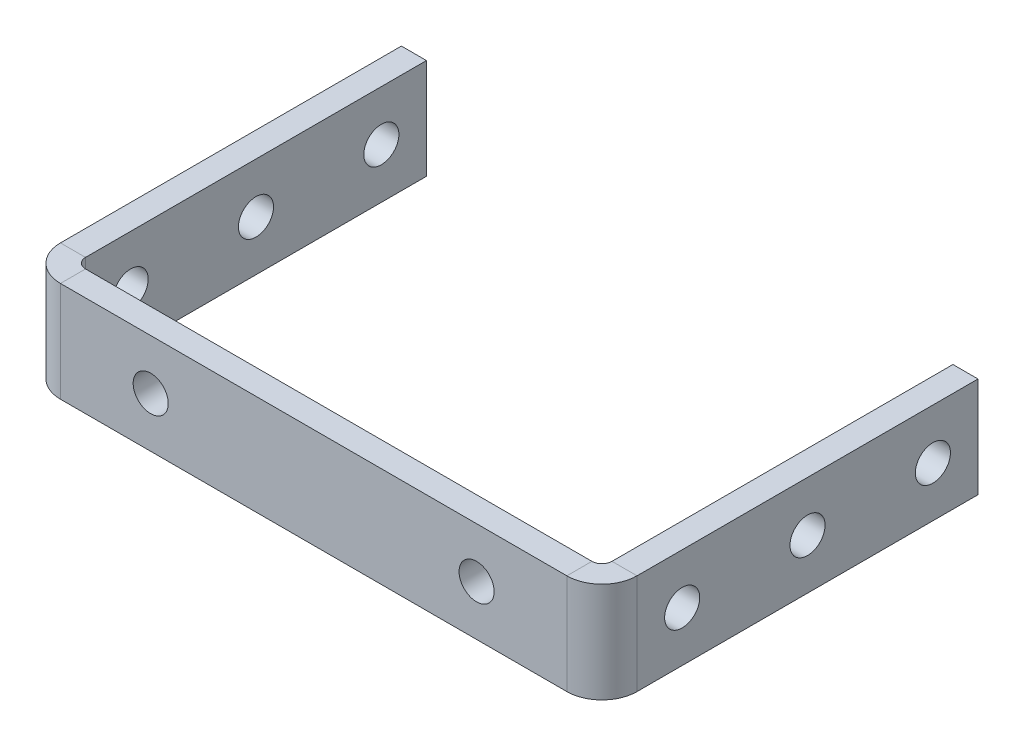
ISO-10303-21;
HEADER;
FILE_DESCRIPTION(('STEP AP214'),'2;1');
FILE_NAME('part.step','',(''),(''),'','','');
FILE_SCHEMA(('AUTOMOTIVE_DESIGN { 1 0 10303 214 1 1 1 1 }'));
ENDSEC;
DATA;
#1=APPLICATION_CONTEXT('core data for automotive mechanical design processes');
#2=APPLICATION_PROTOCOL_DEFINITION('international standard','automotive_design',2000,#1);
#3=PRODUCT_CONTEXT('',#1,'mechanical');
#4=PRODUCT('Part','Part','',(#3));
#5=PRODUCT_RELATED_PRODUCT_CATEGORY('part','',(#4));
#6=PRODUCT_DEFINITION_FORMATION('','',#4);
#7=PRODUCT_DEFINITION_CONTEXT('part definition',#1,'design');
#8=PRODUCT_DEFINITION('design','',#6,#7);
#9=PRODUCT_DEFINITION_SHAPE('','',#8);
#10=(LENGTH_UNIT() NAMED_UNIT(*) SI_UNIT(.MILLI.,.METRE.));
#11=(NAMED_UNIT(*) PLANE_ANGLE_UNIT() SI_UNIT($,.RADIAN.));
#12=(NAMED_UNIT(*) SI_UNIT($,.STERADIAN.) SOLID_ANGLE_UNIT());
#13=UNCERTAINTY_MEASURE_WITH_UNIT(LENGTH_MEASURE(1.E-05),#10,'distance_accuracy_value','');
#14=(GEOMETRIC_REPRESENTATION_CONTEXT(3) GLOBAL_UNCERTAINTY_ASSIGNED_CONTEXT((#13)) GLOBAL_UNIT_ASSIGNED_CONTEXT((#10,
#11,#12)) REPRESENTATION_CONTEXT('',''));
#15=CARTESIAN_POINT('',(0.,0.,0.));
#16=DIRECTION('',(0.,0.,1.));
#17=DIRECTION('',(1.,0.,0.));
#18=AXIS2_PLACEMENT_3D('',#15,#16,#17);
#19=CARTESIAN_POINT('',(-101.,40.,0.));
#20=DIRECTION('',(0.,1.,0.));
#21=DIRECTION('',(0.,0.,1.));
#22=AXIS2_PLACEMENT_3D('',#19,#20,#21);
#23=PLANE('',#22);
#24=DIRECTION('',(0.,0.,1.));
#25=VECTOR('',#24,1.);
#26=CARTESIAN_POINT('',(-101.,40.,0.));
#27=LINE('',#26,#25);
#28=CARTESIAN_POINT('',(-101.,40.,0.));
#29=VERTEX_POINT('',#28);
#30=CARTESIAN_POINT('',(-101.,40.,10.));
#31=VERTEX_POINT('',#30);
#32=EDGE_CURVE('E11',#29,#31,#27,.T.);
#33=ORIENTED_EDGE('',*,*,#32,.F.);
#34=CARTESIAN_POINT('',(-101.,40.,-4.));
#35=DIRECTION('',(0.,-1.,0.));
#36=DIRECTION('',(0.,0.,-1.));
#37=AXIS2_PLACEMENT_3D('',#34,#35,#36);
#38=CIRCLE('',#37,4.);
#39=CARTESIAN_POINT('',(-105.,40.,-4.));
#40=VERTEX_POINT('',#39);
#41=EDGE_CURVE('E249',#40,#29,#38,.F.);
#42=ORIENTED_EDGE('',*,*,#41,.F.);
#43=DIRECTION('',(1.,0.,0.));
#44=VECTOR('',#43,1.);
#45=CARTESIAN_POINT('',(-115.,40.,-4.00000000000001));
#46=LINE('',#45,#44);
#47=CARTESIAN_POINT('',(-115.,40.,-4.00000000000001));
#48=VERTEX_POINT('',#47);
#49=EDGE_CURVE('E46',#48,#40,#46,.T.);
#50=ORIENTED_EDGE('',*,*,#49,.F.);
#51=CARTESIAN_POINT('',(-101.,40.,-4.));
#52=DIRECTION('',(0.,1.,0.));
#53=DIRECTION('',(1.,0.,0.));
#54=AXIS2_PLACEMENT_3D('',#51,#52,#53);
#55=CIRCLE('',#54,14.);
#56=EDGE_CURVE('E147',#48,#31,#55,.T.);
#57=ORIENTED_EDGE('',*,*,#56,.T.);
#58=EDGE_LOOP('',(#33,#42,#50,#57));
#59=FACE_BOUND('',#58,.T.);
#60=ADVANCED_FACE('F38',(#59),#23,.T.);
#61=CARTESIAN_POINT('',(-115.,40.,-4.00000000000001));
#62=DIRECTION('',(0.,1.,0.));
#63=DIRECTION('',(0.,0.,1.));
#64=AXIS2_PLACEMENT_3D('',#61,#62,#63);
#65=PLANE('',#64);
#66=DIRECTION('',(1.,0.,0.));
#67=VECTOR('',#66,1.);
#68=CARTESIAN_POINT('',(-105.,40.,0.));
#69=LINE('',#68,#67);
#70=CARTESIAN_POINT('',(101.,40.,0.));
#71=VERTEX_POINT('',#70);
#72=EDGE_CURVE('E141',#29,#71,#69,.T.);
#73=ORIENTED_EDGE('',*,*,#72,.F.);
#74=ORIENTED_EDGE('',*,*,#32,.T.);
#75=DIRECTION('',(1.,0.,0.));
#76=VECTOR('',#75,1.);
#77=CARTESIAN_POINT('',(-105.,40.,10.));
#78=LINE('',#77,#76);
#79=CARTESIAN_POINT('',(101.,40.,10.));
#80=VERTEX_POINT('',#79);
#81=EDGE_CURVE('E138',#31,#80,#78,.T.);
#82=ORIENTED_EDGE('',*,*,#81,.T.);
#83=DIRECTION('',(0.,0.,-1.));
#84=VECTOR('',#83,1.);
#85=CARTESIAN_POINT('',(101.,40.,10.));
#86=LINE('',#85,#84);
#87=EDGE_CURVE('E230',#80,#71,#86,.T.);
#88=ORIENTED_EDGE('',*,*,#87,.T.);
#89=EDGE_LOOP('',(#73,#74,#82,#88));
#90=FACE_BOUND('',#89,.T.);
#91=ADVANCED_FACE('F136',(#90),#65,.T.);
#92=CARTESIAN_POINT('',(-105.,0.,-4.));
#93=DIRECTION('',(0.,-1.,0.));
#94=DIRECTION('',(0.,0.,-1.));
#95=AXIS2_PLACEMENT_3D('',#92,#93,#94);
#96=PLANE('',#95);
#97=DIRECTION('',(-1.,0.,0.));
#98=VECTOR('',#97,1.);
#99=CARTESIAN_POINT('',(-105.,0.,-4.));
#100=LINE('',#99,#98);
#101=CARTESIAN_POINT('',(-105.,0.,-4.));
#102=VERTEX_POINT('',#101);
#103=CARTESIAN_POINT('',(-115.,0.,-4.00000000000001));
#104=VERTEX_POINT('',#103);
#105=EDGE_CURVE('E235',#102,#104,#100,.T.);
#106=ORIENTED_EDGE('',*,*,#105,.F.);
#107=CARTESIAN_POINT('',(-101.,0.,-4.));
#108=DIRECTION('',(0.,-1.,0.));
#109=DIRECTION('',(0.,0.,-1.));
#110=AXIS2_PLACEMENT_3D('',#107,#108,#109);
#111=CIRCLE('',#110,4.);
#112=CARTESIAN_POINT('',(-101.,0.,0.));
#113=VERTEX_POINT('',#112);
#114=EDGE_CURVE('E187',#102,#113,#111,.F.);
#115=ORIENTED_EDGE('',*,*,#114,.T.);
#116=DIRECTION('',(0.,0.,-1.));
#117=VECTOR('',#116,1.);
#118=CARTESIAN_POINT('',(-101.,0.,10.));
#119=LINE('',#118,#117);
#120=CARTESIAN_POINT('',(-101.,0.,10.));
#121=VERTEX_POINT('',#120);
#122=EDGE_CURVE('E233',#121,#113,#119,.T.);
#123=ORIENTED_EDGE('',*,*,#122,.F.);
#124=CARTESIAN_POINT('',(-101.,0.,-4.));
#125=DIRECTION('',(0.,1.,0.));
#126=DIRECTION('',(1.,0.,0.));
#127=AXIS2_PLACEMENT_3D('',#124,#125,#126);
#128=CIRCLE('',#127,14.);
#129=EDGE_CURVE('E159',#104,#121,#128,.T.);
#130=ORIENTED_EDGE('',*,*,#129,.F.);
#131=EDGE_LOOP('',(#106,#115,#123,#130));
#132=FACE_BOUND('',#131,.T.);
#133=ADVANCED_FACE('F351',(#132),#96,.T.);
#134=CARTESIAN_POINT('',(-101.,0.,10.));
#135=DIRECTION('',(0.,-1.,0.));
#136=DIRECTION('',(0.,0.,-1.));
#137=AXIS2_PLACEMENT_3D('',#134,#135,#136);
#138=PLANE('',#137);
#139=DIRECTION('',(0.,0.,1.));
#140=VECTOR('',#139,1.);
#141=CARTESIAN_POINT('',(-105.,0.,-140.));
#142=LINE('',#141,#140);
#143=CARTESIAN_POINT('',(-105.,0.,-140.));
#144=VERTEX_POINT('',#143);
#145=EDGE_CURVE('E190',#144,#102,#142,.T.);
#146=ORIENTED_EDGE('',*,*,#145,.T.);
#147=ORIENTED_EDGE('',*,*,#105,.T.);
#148=DIRECTION('',(0.,0.,1.));
#149=VECTOR('',#148,1.);
#150=CARTESIAN_POINT('',(-115.,0.,-140.));
#151=LINE('',#150,#149);
#152=CARTESIAN_POINT('',(-115.,0.,-140.));
#153=VERTEX_POINT('',#152);
#154=EDGE_CURVE('E196',#153,#104,#151,.T.);
#155=ORIENTED_EDGE('',*,*,#154,.F.);
#156=DIRECTION('',(1.,0.,0.));
#157=VECTOR('',#156,1.);
#158=CARTESIAN_POINT('',(-115.,0.,-140.));
#159=LINE('',#158,#157);
#160=EDGE_CURVE('E193',#153,#144,#159,.T.);
#161=ORIENTED_EDGE('',*,*,#160,.T.);
#162=EDGE_LOOP('',(#146,#147,#155,#161));
#163=FACE_BOUND('',#162,.T.);
#164=ADVANCED_FACE('F354',(#163),#138,.T.);
#165=CARTESIAN_POINT('',(105.,40.,-4.));
#166=DIRECTION('',(0.,1.,0.));
#167=DIRECTION('',(0.,0.,1.));
#168=AXIS2_PLACEMENT_3D('',#165,#166,#167);
#169=PLANE('',#168);
#170=DIRECTION('',(1.,0.,0.));
#171=VECTOR('',#170,1.);
#172=CARTESIAN_POINT('',(105.,40.,-4.));
#173=LINE('',#172,#171);
#174=CARTESIAN_POINT('',(105.,40.,-4.));
#175=VERTEX_POINT('',#174);
#176=CARTESIAN_POINT('',(115.,40.,-4.));
#177=VERTEX_POINT('',#176);
#178=EDGE_CURVE('E54',#175,#177,#173,.T.);
#179=ORIENTED_EDGE('',*,*,#178,.F.);
#180=CARTESIAN_POINT('',(101.,40.,-4.));
#181=DIRECTION('',(0.,-1.,0.));
#182=DIRECTION('',(0.,0.,-1.));
#183=AXIS2_PLACEMENT_3D('',#180,#181,#182);
#184=CIRCLE('',#183,4.);
#185=EDGE_CURVE('E259',#71,#175,#184,.F.);
#186=ORIENTED_EDGE('',*,*,#185,.F.);
#187=ORIENTED_EDGE('',*,*,#87,.F.);
#188=CARTESIAN_POINT('',(101.,40.,-4.));
#189=DIRECTION('',(0.,1.,0.));
#190=DIRECTION('',(1.,0.,0.));
#191=AXIS2_PLACEMENT_3D('',#188,#189,#190);
#192=CIRCLE('',#191,14.);
#193=EDGE_CURVE('E167',#80,#177,#192,.T.);
#194=ORIENTED_EDGE('',*,*,#193,.T.);
#195=EDGE_LOOP('',(#179,#186,#187,#194));
#196=FACE_BOUND('',#195,.T.);
#197=ADVANCED_FACE('F346',(#196),#169,.T.);
#198=CARTESIAN_POINT('',(101.,40.,10.));
#199=DIRECTION('',(0.,1.,0.));
#200=DIRECTION('',(0.,0.,1.));
#201=AXIS2_PLACEMENT_3D('',#198,#199,#200);
#202=PLANE('',#201);
#203=DIRECTION('',(0.,0.,-1.));
#204=VECTOR('',#203,1.);
#205=CARTESIAN_POINT('',(105.,40.,0.));
#206=LINE('',#205,#204);
#207=CARTESIAN_POINT('',(105.,40.,-140.));
#208=VERTEX_POINT('',#207);
#209=EDGE_CURVE('E262',#175,#208,#206,.T.);
#210=ORIENTED_EDGE('',*,*,#209,.F.);
#211=ORIENTED_EDGE('',*,*,#178,.T.);
#212=DIRECTION('',(0.,0.,-1.));
#213=VECTOR('',#212,1.);
#214=CARTESIAN_POINT('',(115.,40.,0.));
#215=LINE('',#214,#213);
#216=CARTESIAN_POINT('',(115.,40.,-140.));
#217=VERTEX_POINT('',#216);
#218=EDGE_CURVE('E108',#177,#217,#215,.T.);
#219=ORIENTED_EDGE('',*,*,#218,.T.);
#220=DIRECTION('',(1.,0.,0.));
#221=VECTOR('',#220,1.);
#222=CARTESIAN_POINT('',(105.,40.,-140.));
#223=LINE('',#222,#221);
#224=EDGE_CURVE('E265',#208,#217,#223,.T.);
#225=ORIENTED_EDGE('',*,*,#224,.F.);
#226=EDGE_LOOP('',(#210,#211,#219,#225));
#227=FACE_BOUND('',#226,.T.);
#228=ADVANCED_FACE('F336',(#227),#202,.T.);
#229=CARTESIAN_POINT('',(101.,0.,0.));
#230=DIRECTION('',(0.,-1.,0.));
#231=DIRECTION('',(0.,0.,-1.));
#232=AXIS2_PLACEMENT_3D('',#229,#230,#231);
#233=PLANE('',#232);
#234=DIRECTION('',(0.,0.,1.));
#235=VECTOR('',#234,1.);
#236=CARTESIAN_POINT('',(101.,0.,0.));
#237=LINE('',#236,#235);
#238=CARTESIAN_POINT('',(101.,0.,0.));
#239=VERTEX_POINT('',#238);
#240=CARTESIAN_POINT('',(101.,0.,10.));
#241=VERTEX_POINT('',#240);
#242=EDGE_CURVE('E95',#239,#241,#237,.T.);
#243=ORIENTED_EDGE('',*,*,#242,.F.);
#244=CARTESIAN_POINT('',(101.,0.,-4.));
#245=DIRECTION('',(0.,-1.,0.));
#246=DIRECTION('',(0.,0.,-1.));
#247=AXIS2_PLACEMENT_3D('',#244,#245,#246);
#248=CIRCLE('',#247,4.);
#249=CARTESIAN_POINT('',(105.,0.,-4.));
#250=VERTEX_POINT('',#249);
#251=EDGE_CURVE('E183',#239,#250,#248,.F.);
#252=ORIENTED_EDGE('',*,*,#251,.T.);
#253=DIRECTION('',(-1.,0.,0.));
#254=VECTOR('',#253,1.);
#255=CARTESIAN_POINT('',(115.,0.,-4.));
#256=LINE('',#255,#254);
#257=CARTESIAN_POINT('',(115.,0.,-4.));
#258=VERTEX_POINT('',#257);
#259=EDGE_CURVE('E102',#258,#250,#256,.T.);
#260=ORIENTED_EDGE('',*,*,#259,.F.);
#261=CARTESIAN_POINT('',(101.,0.,-4.));
#262=DIRECTION('',(0.,1.,0.));
#263=DIRECTION('',(1.,0.,0.));
#264=AXIS2_PLACEMENT_3D('',#261,#262,#263);
#265=CIRCLE('',#264,14.);
#266=EDGE_CURVE('E202',#241,#258,#265,.T.);
#267=ORIENTED_EDGE('',*,*,#266,.F.);
#268=EDGE_LOOP('',(#243,#252,#260,#267));
#269=FACE_BOUND('',#268,.T.);
#270=ADVANCED_FACE('F385',(#269),#233,.T.);
#271=CARTESIAN_POINT('',(115.,0.,-4.));
#272=DIRECTION('',(0.,-1.,0.));
#273=DIRECTION('',(0.,0.,-1.));
#274=AXIS2_PLACEMENT_3D('',#271,#272,#273);
#275=PLANE('',#274);
#276=DIRECTION('',(1.,0.,0.));
#277=VECTOR('',#276,1.);
#278=CARTESIAN_POINT('',(-105.,0.,0.));
#279=LINE('',#278,#277);
#280=EDGE_CURVE('E185',#113,#239,#279,.T.);
#281=ORIENTED_EDGE('',*,*,#280,.T.);
#282=ORIENTED_EDGE('',*,*,#242,.T.);
#283=DIRECTION('',(1.,0.,0.));
#284=VECTOR('',#283,1.);
#285=CARTESIAN_POINT('',(-105.,0.,10.));
#286=LINE('',#285,#284);
#287=EDGE_CURVE('E200',#121,#241,#286,.T.);
#288=ORIENTED_EDGE('',*,*,#287,.F.);
#289=ORIENTED_EDGE('',*,*,#122,.T.);
#290=EDGE_LOOP('',(#281,#282,#288,#289));
#291=FACE_BOUND('',#290,.T.);
#292=ADVANCED_FACE('F323',(#291),#275,.T.);
#293=CARTESIAN_POINT('',(115.,40.,0.));
#294=DIRECTION('',(-1.,0.,0.));
#295=DIRECTION('',(0.,0.,1.));
#296=AXIS2_PLACEMENT_3D('',#293,#294,#295);
#297=PLANE('',#296);
#298=CARTESIAN_POINT('',(115.,20.,-122.));
#299=DIRECTION('',(1.,0.,0.));
#300=DIRECTION('',(0.,0.,-1.));
#301=AXIS2_PLACEMENT_3D('',#298,#299,#300);
#302=CIRCLE('',#301,7.00000000000004);
#303=CARTESIAN_POINT('',(115.,20.,-129.));
#304=VERTEX_POINT('',#303);
#305=EDGE_CURVE('E309',#304,#304,#302,.T.);
#306=ORIENTED_EDGE('',*,*,#305,.F.);
#307=EDGE_LOOP('',(#306));
#308=FACE_BOUND('',#307,.T.);
#309=CARTESIAN_POINT('',(115.,20.,-72.));
#310=DIRECTION('',(1.,0.,0.));
#311=DIRECTION('',(0.,0.,-1.));
#312=AXIS2_PLACEMENT_3D('',#309,#310,#311);
#313=CIRCLE('',#312,7.);
#314=CARTESIAN_POINT('',(115.,20.,-79.));
#315=VERTEX_POINT('',#314);
#316=EDGE_CURVE('E302',#315,#315,#313,.T.);
#317=ORIENTED_EDGE('',*,*,#316,.F.);
#318=EDGE_LOOP('',(#317));
#319=FACE_BOUND('',#318,.T.);
#320=CARTESIAN_POINT('',(115.,20.,-22.));
#321=DIRECTION('',(1.,0.,0.));
#322=DIRECTION('',(0.,0.,-1.));
#323=AXIS2_PLACEMENT_3D('',#320,#321,#322);
#324=CIRCLE('',#323,7.);
#325=CARTESIAN_POINT('',(115.,20.,-29.));
#326=VERTEX_POINT('',#325);
#327=EDGE_CURVE('E303',#326,#326,#324,.T.);
#328=ORIENTED_EDGE('',*,*,#327,.F.);
#329=EDGE_LOOP('',(#328));
#330=FACE_BOUND('',#329,.T.);
#331=DIRECTION('',(0.,0.,-1.));
#332=VECTOR('',#331,1.);
#333=CARTESIAN_POINT('',(115.,0.,0.));
#334=LINE('',#333,#332);
#335=CARTESIAN_POINT('',(115.,0.,-140.));
#336=VERTEX_POINT('',#335);
#337=EDGE_CURVE('E173',#258,#336,#334,.T.);
#338=ORIENTED_EDGE('',*,*,#337,.T.);
#339=DIRECTION('',(0.,-1.,0.));
#340=VECTOR('',#339,1.);
#341=CARTESIAN_POINT('',(115.,40.,-140.));
#342=LINE('',#341,#340);
#343=EDGE_CURVE('E226',#217,#336,#342,.T.);
#344=ORIENTED_EDGE('',*,*,#343,.F.);
#345=ORIENTED_EDGE('',*,*,#218,.F.);
#346=DIRECTION('',(0.,-1.,0.));
#347=VECTOR('',#346,1.);
#348=CARTESIAN_POINT('',(115.,40.,-4.));
#349=LINE('',#348,#347);
#350=EDGE_CURVE('E169',#177,#258,#349,.T.);
#351=ORIENTED_EDGE('',*,*,#350,.T.);
#352=EDGE_LOOP('',(#338,#344,#345,#351));
#353=FACE_BOUND('',#352,.T.);
#354=ADVANCED_FACE('F319',(#308,#319,#330,#353),#297,.F.);
#355=CARTESIAN_POINT('',(105.,40.,-140.));
#356=DIRECTION('',(0.,0.,-1.));
#357=DIRECTION('',(-1.,0.,0.));
#358=AXIS2_PLACEMENT_3D('',#355,#356,#357);
#359=PLANE('',#358);
#360=DIRECTION('',(1.,0.,0.));
#361=VECTOR('',#360,1.);
#362=CARTESIAN_POINT('',(105.,0.,-140.));
#363=LINE('',#362,#361);
#364=CARTESIAN_POINT('',(105.,0.,-140.));
#365=VERTEX_POINT('',#364);
#366=EDGE_CURVE('E176',#365,#336,#363,.T.);
#367=ORIENTED_EDGE('',*,*,#366,.F.);
#368=DIRECTION('',(0.,-1.,0.));
#369=VECTOR('',#368,1.);
#370=CARTESIAN_POINT('',(105.,40.,-140.));
#371=LINE('',#370,#369);
#372=EDGE_CURVE('E224',#208,#365,#371,.T.);
#373=ORIENTED_EDGE('',*,*,#372,.F.);
#374=ORIENTED_EDGE('',*,*,#224,.T.);
#375=ORIENTED_EDGE('',*,*,#343,.T.);
#376=EDGE_LOOP('',(#367,#373,#374,#375));
#377=FACE_BOUND('',#376,.T.);
#378=ADVANCED_FACE('F322',(#377),#359,.T.);
#379=CARTESIAN_POINT('',(105.,40.,0.));
#380=DIRECTION('',(-1.,0.,0.));
#381=DIRECTION('',(0.,0.,1.));
#382=AXIS2_PLACEMENT_3D('',#379,#380,#381);
#383=PLANE('',#382);
#384=CARTESIAN_POINT('',(105.,20.,-122.));
#385=DIRECTION('',(-1.,0.,0.));
#386=DIRECTION('',(0.,0.,1.));
#387=AXIS2_PLACEMENT_3D('',#384,#385,#386);
#388=CIRCLE('',#387,7.00000000000004);
#389=CARTESIAN_POINT('',(105.,20.,-115.));
#390=VERTEX_POINT('',#389);
#391=EDGE_CURVE('E273',#390,#390,#388,.T.);
#392=ORIENTED_EDGE('',*,*,#391,.F.);
#393=EDGE_LOOP('',(#392));
#394=FACE_BOUND('',#393,.T.);
#395=CARTESIAN_POINT('',(105.,20.,-72.));
#396=DIRECTION('',(-1.,0.,0.));
#397=DIRECTION('',(0.,0.,1.));
#398=AXIS2_PLACEMENT_3D('',#395,#396,#397);
#399=CIRCLE('',#398,7.);
#400=CARTESIAN_POINT('',(105.,20.,-65.));
#401=VERTEX_POINT('',#400);
#402=EDGE_CURVE('E286',#401,#401,#399,.T.);
#403=ORIENTED_EDGE('',*,*,#402,.F.);
#404=EDGE_LOOP('',(#403));
#405=FACE_BOUND('',#404,.T.);
#406=CARTESIAN_POINT('',(105.,20.,-22.));
#407=DIRECTION('',(-1.,0.,0.));
#408=DIRECTION('',(0.,0.,1.));
#409=AXIS2_PLACEMENT_3D('',#406,#407,#408);
#410=CIRCLE('',#409,7.);
#411=CARTESIAN_POINT('',(105.,20.,-15.));
#412=VERTEX_POINT('',#411);
#413=EDGE_CURVE('E292',#412,#412,#410,.T.);
#414=ORIENTED_EDGE('',*,*,#413,.F.);
#415=EDGE_LOOP('',(#414));
#416=FACE_BOUND('',#415,.T.);
#417=DIRECTION('',(0.,0.,-1.));
#418=VECTOR('',#417,1.);
#419=CARTESIAN_POINT('',(105.,0.,0.));
#420=LINE('',#419,#418);
#421=EDGE_CURVE('E180',#250,#365,#420,.T.);
#422=ORIENTED_EDGE('',*,*,#421,.F.);
#423=DIRECTION('',(0.,-1.,0.));
#424=VECTOR('',#423,1.);
#425=CARTESIAN_POINT('',(105.,40.,-4.));
#426=LINE('',#425,#424);
#427=EDGE_CURVE('E221',#175,#250,#426,.T.);
#428=ORIENTED_EDGE('',*,*,#427,.F.);
#429=ORIENTED_EDGE('',*,*,#209,.T.);
#430=ORIENTED_EDGE('',*,*,#372,.T.);
#431=EDGE_LOOP('',(#422,#428,#429,#430));
#432=FACE_BOUND('',#431,.T.);
#433=ADVANCED_FACE('F339',(#394,#405,#416,#432),#383,.T.);
#434=CARTESIAN_POINT('',(101.,40.,-4.));
#435=DIRECTION('',(0.,-1.,0.));
#436=DIRECTION('',(0.,0.,-1.));
#437=AXIS2_PLACEMENT_3D('',#434,#435,#436);
#438=CYLINDRICAL_SURFACE('',#437,4.);
#439=ORIENTED_EDGE('',*,*,#251,.F.);
#440=DIRECTION('',(0.,-1.,0.));
#441=VECTOR('',#440,1.);
#442=CARTESIAN_POINT('',(101.,40.,0.));
#443=LINE('',#442,#441);
#444=EDGE_CURVE('E218',#71,#239,#443,.T.);
#445=ORIENTED_EDGE('',*,*,#444,.F.);
#446=ORIENTED_EDGE('',*,*,#185,.T.);
#447=ORIENTED_EDGE('',*,*,#427,.T.);
#448=EDGE_LOOP('',(#439,#445,#446,#447));
#449=FACE_BOUND('',#448,.T.);
#450=ADVANCED_FACE('F342',(#449),#438,.F.);
#451=CARTESIAN_POINT('',(-105.,40.,0.));
#452=DIRECTION('',(0.,0.,-1.));
#453=DIRECTION('',(-1.,0.,0.));
#454=AXIS2_PLACEMENT_3D('',#451,#452,#453);
#455=PLANE('',#454);
#456=CARTESIAN_POINT('',(-65.,20.,0.));
#457=DIRECTION('',(0.,0.,-1.));
#458=DIRECTION('',(-1.,0.,0.));
#459=AXIS2_PLACEMENT_3D('',#456,#457,#458);
#460=CIRCLE('',#459,7.);
#461=CARTESIAN_POINT('',(-72.,20.,0.));
#462=VERTEX_POINT('',#461);
#463=EDGE_CURVE('E276',#462,#462,#460,.F.);
#464=ORIENTED_EDGE('',*,*,#463,.T.);
#465=EDGE_LOOP('',(#464));
#466=FACE_BOUND('',#465,.T.);
#467=CARTESIAN_POINT('',(65.,20.,0.));
#468=DIRECTION('',(0.,0.,-1.));
#469=DIRECTION('',(-1.,0.,0.));
#470=AXIS2_PLACEMENT_3D('',#467,#468,#469);
#471=CIRCLE('',#470,7.);
#472=CARTESIAN_POINT('',(58.,20.,0.));
#473=VERTEX_POINT('',#472);
#474=EDGE_CURVE('E269',#473,#473,#471,.F.);
#475=ORIENTED_EDGE('',*,*,#474,.T.);
#476=EDGE_LOOP('',(#475));
#477=FACE_BOUND('',#476,.T.);
#478=ORIENTED_EDGE('',*,*,#280,.F.);
#479=DIRECTION('',(0.,-1.,0.));
#480=VECTOR('',#479,1.);
#481=CARTESIAN_POINT('',(-101.,40.,0.));
#482=LINE('',#481,#480);
#483=EDGE_CURVE('E215',#29,#113,#482,.T.);
#484=ORIENTED_EDGE('',*,*,#483,.F.);
#485=ORIENTED_EDGE('',*,*,#72,.T.);
#486=ORIENTED_EDGE('',*,*,#444,.T.);
#487=EDGE_LOOP('',(#478,#484,#485,#486));
#488=FACE_BOUND('',#487,.T.);
#489=ADVANCED_FACE('F349',(#466,#477,#488),#455,.T.);
#490=CARTESIAN_POINT('',(-101.,40.,-4.));
#491=DIRECTION('',(0.,-1.,0.));
#492=DIRECTION('',(0.,0.,-1.));
#493=AXIS2_PLACEMENT_3D('',#490,#491,#492);
#494=CYLINDRICAL_SURFACE('',#493,4.);
#495=ORIENTED_EDGE('',*,*,#114,.F.);
#496=DIRECTION('',(0.,-1.,0.));
#497=VECTOR('',#496,1.);
#498=CARTESIAN_POINT('',(-105.,40.,-4.));
#499=LINE('',#498,#497);
#500=EDGE_CURVE('E212',#40,#102,#499,.T.);
#501=ORIENTED_EDGE('',*,*,#500,.F.);
#502=ORIENTED_EDGE('',*,*,#41,.T.);
#503=ORIENTED_EDGE('',*,*,#483,.T.);
#504=EDGE_LOOP('',(#495,#501,#502,#503));
#505=FACE_BOUND('',#504,.T.);
#506=ADVANCED_FACE('F248',(#505),#494,.F.);
#507=CARTESIAN_POINT('',(-105.,40.,-140.));
#508=DIRECTION('',(1.,0.,0.));
#509=DIRECTION('',(0.,0.,-1.));
#510=AXIS2_PLACEMENT_3D('',#507,#508,#509);
#511=PLANE('',#510);
#512=CARTESIAN_POINT('',(-105.,20.,-122.));
#513=DIRECTION('',(1.,0.,0.));
#514=DIRECTION('',(0.,0.,-1.));
#515=AXIS2_PLACEMENT_3D('',#512,#513,#514);
#516=CIRCLE('',#515,7.00000000000004);
#517=CARTESIAN_POINT('',(-105.,20.,-129.));
#518=VERTEX_POINT('',#517);
#519=EDGE_CURVE('E283',#518,#518,#516,.T.);
#520=ORIENTED_EDGE('',*,*,#519,.F.);
#521=EDGE_LOOP('',(#520));
#522=FACE_BOUND('',#521,.T.);
#523=CARTESIAN_POINT('',(-105.,20.,-72.));
#524=DIRECTION('',(1.,0.,0.));
#525=DIRECTION('',(0.,0.,-1.));
#526=AXIS2_PLACEMENT_3D('',#523,#524,#525);
#527=CIRCLE('',#526,7.);
#528=CARTESIAN_POINT('',(-105.,20.,-79.));
#529=VERTEX_POINT('',#528);
#530=EDGE_CURVE('E289',#529,#529,#527,.T.);
#531=ORIENTED_EDGE('',*,*,#530,.F.);
#532=EDGE_LOOP('',(#531));
#533=FACE_BOUND('',#532,.T.);
#534=CARTESIAN_POINT('',(-105.,20.,-22.));
#535=DIRECTION('',(1.,0.,0.));
#536=DIRECTION('',(0.,0.,-1.));
#537=AXIS2_PLACEMENT_3D('',#534,#535,#536);
#538=CIRCLE('',#537,7.);
#539=CARTESIAN_POINT('',(-105.,20.,-29.));
#540=VERTEX_POINT('',#539);
#541=EDGE_CURVE('E295',#540,#540,#538,.T.);
#542=ORIENTED_EDGE('',*,*,#541,.F.);
#543=EDGE_LOOP('',(#542));
#544=FACE_BOUND('',#543,.T.);
#545=ORIENTED_EDGE('',*,*,#145,.F.);
#546=DIRECTION('',(0.,-1.,0.));
#547=VECTOR('',#546,1.);
#548=CARTESIAN_POINT('',(-105.,40.,-140.));
#549=LINE('',#548,#547);
#550=CARTESIAN_POINT('',(-105.,40.,-140.));
#551=VERTEX_POINT('',#550);
#552=EDGE_CURVE('E210',#551,#144,#549,.T.);
#553=ORIENTED_EDGE('',*,*,#552,.F.);
#554=DIRECTION('',(0.,0.,1.));
#555=VECTOR('',#554,1.);
#556=CARTESIAN_POINT('',(-105.,40.,-140.));
#557=LINE('',#556,#555);
#558=EDGE_CURVE('E242',#551,#40,#557,.T.);
#559=ORIENTED_EDGE('',*,*,#558,.T.);
#560=ORIENTED_EDGE('',*,*,#500,.T.);
#561=EDGE_LOOP('',(#545,#553,#559,#560));
#562=FACE_BOUND('',#561,.T.);
#563=ADVANCED_FACE('F253',(#522,#533,#544,#562),#511,.T.);
#564=CARTESIAN_POINT('',(-115.,40.,-140.));
#565=DIRECTION('',(0.,0.,-1.));
#566=DIRECTION('',(-1.,0.,0.));
#567=AXIS2_PLACEMENT_3D('',#564,#565,#566);
#568=PLANE('',#567);
#569=ORIENTED_EDGE('',*,*,#160,.F.);
#570=DIRECTION('',(0.,-1.,0.));
#571=VECTOR('',#570,1.);
#572=CARTESIAN_POINT('',(-115.,40.,-140.));
#573=LINE('',#572,#571);
#574=CARTESIAN_POINT('',(-115.,40.,-140.));
#575=VERTEX_POINT('',#574);
#576=EDGE_CURVE('E208',#575,#153,#573,.T.);
#577=ORIENTED_EDGE('',*,*,#576,.F.);
#578=DIRECTION('',(1.,0.,0.));
#579=VECTOR('',#578,1.);
#580=CARTESIAN_POINT('',(-115.,40.,-140.));
#581=LINE('',#580,#579);
#582=EDGE_CURVE('E254',#575,#551,#581,.T.);
#583=ORIENTED_EDGE('',*,*,#582,.T.);
#584=ORIENTED_EDGE('',*,*,#552,.T.);
#585=EDGE_LOOP('',(#569,#577,#583,#584));
#586=FACE_BOUND('',#585,.T.);
#587=ADVANCED_FACE('F359',(#586),#568,.T.);
#588=CARTESIAN_POINT('',(-115.,40.,-140.));
#589=DIRECTION('',(1.,0.,0.));
#590=DIRECTION('',(0.,0.,-1.));
#591=AXIS2_PLACEMENT_3D('',#588,#589,#590);
#592=PLANE('',#591);
#593=CARTESIAN_POINT('',(-115.,20.,-122.));
#594=DIRECTION('',(1.,0.,0.));
#595=DIRECTION('',(0.,0.,-1.));
#596=AXIS2_PLACEMENT_3D('',#593,#594,#595);
#597=CIRCLE('',#596,7.00000000000004);
#598=CARTESIAN_POINT('',(-115.,20.,-129.));
#599=VERTEX_POINT('',#598);
#600=EDGE_CURVE('E298',#599,#599,#597,.F.);
#601=ORIENTED_EDGE('',*,*,#600,.F.);
#602=EDGE_LOOP('',(#601));
#603=FACE_BOUND('',#602,.T.);
#604=CARTESIAN_POINT('',(-115.,20.,-72.));
#605=DIRECTION('',(1.,0.,0.));
#606=DIRECTION('',(0.,0.,-1.));
#607=AXIS2_PLACEMENT_3D('',#604,#605,#606);
#608=CIRCLE('',#607,7.);
#609=CARTESIAN_POINT('',(-115.,20.,-79.));
#610=VERTEX_POINT('',#609);
#611=EDGE_CURVE('E306',#610,#610,#608,.F.);
#612=ORIENTED_EDGE('',*,*,#611,.F.);
#613=EDGE_LOOP('',(#612));
#614=FACE_BOUND('',#613,.T.);
#615=CARTESIAN_POINT('',(-115.,20.,-22.));
#616=DIRECTION('',(1.,0.,0.));
#617=DIRECTION('',(0.,0.,-1.));
#618=AXIS2_PLACEMENT_3D('',#615,#616,#617);
#619=CIRCLE('',#618,7.);
#620=CARTESIAN_POINT('',(-115.,20.,-29.));
#621=VERTEX_POINT('',#620);
#622=EDGE_CURVE('E299',#621,#621,#619,.F.);
#623=ORIENTED_EDGE('',*,*,#622,.F.);
#624=EDGE_LOOP('',(#623));
#625=FACE_BOUND('',#624,.T.);
#626=ORIENTED_EDGE('',*,*,#154,.T.);
#627=DIRECTION('',(0.,-1.,0.));
#628=VECTOR('',#627,1.);
#629=CARTESIAN_POINT('',(-115.,40.,-4.00000000000001));
#630=LINE('',#629,#628);
#631=EDGE_CURVE('E161',#48,#104,#630,.T.);
#632=ORIENTED_EDGE('',*,*,#631,.F.);
#633=DIRECTION('',(0.,0.,1.));
#634=VECTOR('',#633,1.);
#635=CARTESIAN_POINT('',(-115.,40.,-140.));
#636=LINE('',#635,#634);
#637=EDGE_CURVE('E152',#575,#48,#636,.T.);
#638=ORIENTED_EDGE('',*,*,#637,.F.);
#639=ORIENTED_EDGE('',*,*,#576,.T.);
#640=EDGE_LOOP('',(#626,#632,#638,#639));
#641=FACE_BOUND('',#640,.T.);
#642=ADVANCED_FACE('F357',(#603,#614,#625,#641),#592,.F.);
#643=CARTESIAN_POINT('',(-101.,40.,-4.));
#644=DIRECTION('',(0.,-1.,0.));
#645=DIRECTION('',(0.,0.,-1.));
#646=AXIS2_PLACEMENT_3D('',#643,#644,#645);
#647=CYLINDRICAL_SURFACE('',#646,14.);
#648=ORIENTED_EDGE('',*,*,#129,.T.);
#649=DIRECTION('',(0.,-1.,0.));
#650=VECTOR('',#649,1.);
#651=CARTESIAN_POINT('',(-101.,40.,10.));
#652=LINE('',#651,#650);
#653=EDGE_CURVE('E156',#31,#121,#652,.T.);
#654=ORIENTED_EDGE('',*,*,#653,.F.);
#655=ORIENTED_EDGE('',*,*,#56,.F.);
#656=ORIENTED_EDGE('',*,*,#631,.T.);
#657=EDGE_LOOP('',(#648,#654,#655,#656));
#658=FACE_BOUND('',#657,.T.);
#659=ADVANCED_FACE('F157',(#658),#647,.T.);
#660=CARTESIAN_POINT('',(-105.,40.,10.));
#661=DIRECTION('',(0.,0.,-1.));
#662=DIRECTION('',(-1.,0.,0.));
#663=AXIS2_PLACEMENT_3D('',#660,#661,#662);
#664=PLANE('',#663);
#665=CARTESIAN_POINT('',(-65.,20.,10.));
#666=DIRECTION('',(0.,0.,1.));
#667=DIRECTION('',(1.,0.,0.));
#668=AXIS2_PLACEMENT_3D('',#665,#666,#667);
#669=CIRCLE('',#668,7.);
#670=CARTESIAN_POINT('',(-58.,20.,10.));
#671=VERTEX_POINT('',#670);
#672=EDGE_CURVE('E177',#671,#671,#669,.T.);
#673=ORIENTED_EDGE('',*,*,#672,.F.);
#674=EDGE_LOOP('',(#673));
#675=FACE_BOUND('',#674,.T.);
#676=CARTESIAN_POINT('',(65.,20.,10.));
#677=DIRECTION('',(0.,0.,1.));
#678=DIRECTION('',(1.,0.,0.));
#679=AXIS2_PLACEMENT_3D('',#676,#677,#678);
#680=CIRCLE('',#679,7.);
#681=CARTESIAN_POINT('',(72.,20.,10.));
#682=VERTEX_POINT('',#681);
#683=EDGE_CURVE('E272',#682,#682,#680,.T.);
#684=ORIENTED_EDGE('',*,*,#683,.F.);
#685=EDGE_LOOP('',(#684));
#686=FACE_BOUND('',#685,.T.);
#687=ORIENTED_EDGE('',*,*,#287,.T.);
#688=DIRECTION('',(0.,-1.,0.));
#689=VECTOR('',#688,1.);
#690=CARTESIAN_POINT('',(101.,40.,10.));
#691=LINE('',#690,#689);
#692=EDGE_CURVE('E162',#80,#241,#691,.T.);
#693=ORIENTED_EDGE('',*,*,#692,.F.);
#694=ORIENTED_EDGE('',*,*,#81,.F.);
#695=ORIENTED_EDGE('',*,*,#653,.T.);
#696=EDGE_LOOP('',(#687,#693,#694,#695));
#697=FACE_BOUND('',#696,.T.);
#698=ADVANCED_FACE('F164',(#675,#686,#697),#664,.F.);
#699=CARTESIAN_POINT('',(101.,40.,-4.));
#700=DIRECTION('',(0.,-1.,0.));
#701=DIRECTION('',(0.,0.,-1.));
#702=AXIS2_PLACEMENT_3D('',#699,#700,#701);
#703=CYLINDRICAL_SURFACE('',#702,14.);
#704=ORIENTED_EDGE('',*,*,#266,.T.);
#705=ORIENTED_EDGE('',*,*,#350,.F.);
#706=ORIENTED_EDGE('',*,*,#193,.F.);
#707=ORIENTED_EDGE('',*,*,#692,.T.);
#708=EDGE_LOOP('',(#704,#705,#706,#707));
#709=FACE_BOUND('',#708,.T.);
#710=ADVANCED_FACE('F558',(#709),#703,.T.);
#711=CARTESIAN_POINT('',(101.,40.,-4.));
#712=DIRECTION('',(0.,-1.,0.));
#713=DIRECTION('',(-1.,0.,0.));
#714=AXIS2_PLACEMENT_3D('',#711,#712,#713);
#715=PLANE('',#714);
#716=ORIENTED_EDGE('',*,*,#637,.T.);
#717=ORIENTED_EDGE('',*,*,#49,.T.);
#718=ORIENTED_EDGE('',*,*,#558,.F.);
#719=ORIENTED_EDGE('',*,*,#582,.F.);
#720=EDGE_LOOP('',(#716,#717,#718,#719));
#721=FACE_BOUND('',#720,.T.);
#722=ADVANCED_FACE('F239',(#721),#715,.F.);
#723=CARTESIAN_POINT('',(101.,0.,-4.));
#724=DIRECTION('',(0.,-1.,0.));
#725=DIRECTION('',(-1.,0.,0.));
#726=AXIS2_PLACEMENT_3D('',#723,#724,#725);
#727=PLANE('',#726);
#728=ORIENTED_EDGE('',*,*,#337,.F.);
#729=ORIENTED_EDGE('',*,*,#259,.T.);
#730=ORIENTED_EDGE('',*,*,#421,.T.);
#731=ORIENTED_EDGE('',*,*,#366,.T.);
#732=EDGE_LOOP('',(#728,#729,#730,#731));
#733=FACE_BOUND('',#732,.T.);
#734=ADVANCED_FACE('F333',(#733),#727,.T.);
#735=CARTESIAN_POINT('',(65.,20.,-140.001));
#736=DIRECTION('',(0.,0.,1.));
#737=DIRECTION('',(1.,0.,0.));
#738=AXIS2_PLACEMENT_3D('',#735,#736,#737);
#739=CYLINDRICAL_SURFACE('',#738,7.);
#740=ORIENTED_EDGE('',*,*,#474,.F.);
#741=EDGE_LOOP('',(#740));
#742=FACE_BOUND('',#741,.T.);
#743=ORIENTED_EDGE('',*,*,#683,.T.);
#744=EDGE_LOOP('',(#743));
#745=FACE_BOUND('',#744,.T.);
#746=ADVANCED_FACE('F503',(#742,#745),#739,.F.);
#747=CARTESIAN_POINT('',(-65.,20.,-140.001));
#748=DIRECTION('',(0.,0.,1.));
#749=DIRECTION('',(1.,0.,0.));
#750=AXIS2_PLACEMENT_3D('',#747,#748,#749);
#751=CYLINDRICAL_SURFACE('',#750,7.);
#752=ORIENTED_EDGE('',*,*,#463,.F.);
#753=EDGE_LOOP('',(#752));
#754=FACE_BOUND('',#753,.T.);
#755=ORIENTED_EDGE('',*,*,#672,.T.);
#756=EDGE_LOOP('',(#755));
#757=FACE_BOUND('',#756,.T.);
#758=ADVANCED_FACE('F436',(#754,#757),#751,.F.);
#759=CARTESIAN_POINT('',(-134.798989873223,20.,-22.));
#760=DIRECTION('',(1.,0.,0.));
#761=DIRECTION('',(0.,0.,-1.));
#762=AXIS2_PLACEMENT_3D('',#759,#760,#761);
#763=CYLINDRICAL_SURFACE('',#762,7.);
#764=ORIENTED_EDGE('',*,*,#541,.T.);
#765=EDGE_LOOP('',(#764));
#766=FACE_BOUND('',#765,.T.);
#767=ORIENTED_EDGE('',*,*,#622,.T.);
#768=EDGE_LOOP('',(#767));
#769=FACE_BOUND('',#768,.T.);
#770=ADVANCED_FACE('F430',(#766,#769),#763,.F.);
#771=CARTESIAN_POINT('',(-134.798989873223,20.,-72.));
#772=DIRECTION('',(1.,0.,0.));
#773=DIRECTION('',(0.,0.,-1.));
#774=AXIS2_PLACEMENT_3D('',#771,#772,#773);
#775=CYLINDRICAL_SURFACE('',#774,7.);
#776=ORIENTED_EDGE('',*,*,#530,.T.);
#777=EDGE_LOOP('',(#776));
#778=FACE_BOUND('',#777,.T.);
#779=ORIENTED_EDGE('',*,*,#611,.T.);
#780=EDGE_LOOP('',(#779));
#781=FACE_BOUND('',#780,.T.);
#782=ADVANCED_FACE('F435',(#778,#781),#775,.F.);
#783=CARTESIAN_POINT('',(-134.798989873223,20.,-122.));
#784=DIRECTION('',(1.,0.,0.));
#785=DIRECTION('',(0.,0.,-1.));
#786=AXIS2_PLACEMENT_3D('',#783,#784,#785);
#787=CYLINDRICAL_SURFACE('',#786,7.00000000000004);
#788=ORIENTED_EDGE('',*,*,#519,.T.);
#789=EDGE_LOOP('',(#788));
#790=FACE_BOUND('',#789,.T.);
#791=ORIENTED_EDGE('',*,*,#600,.T.);
#792=EDGE_LOOP('',(#791));
#793=FACE_BOUND('',#792,.T.);
#794=ADVANCED_FACE('F450',(#790,#793),#787,.F.);
#795=ORIENTED_EDGE('',*,*,#413,.T.);
#796=EDGE_LOOP('',(#795));
#797=FACE_BOUND('',#796,.T.);
#798=ORIENTED_EDGE('',*,*,#327,.T.);
#799=EDGE_LOOP('',(#798));
#800=FACE_BOUND('',#799,.T.);
#801=ADVANCED_FACE('F439',(#797,#800),#763,.F.);
#802=ORIENTED_EDGE('',*,*,#402,.T.);
#803=EDGE_LOOP('',(#802));
#804=FACE_BOUND('',#803,.T.);
#805=ORIENTED_EDGE('',*,*,#316,.T.);
#806=EDGE_LOOP('',(#805));
#807=FACE_BOUND('',#806,.T.);
#808=ADVANCED_FACE('F453',(#804,#807),#775,.F.);
#809=ORIENTED_EDGE('',*,*,#391,.T.);
#810=EDGE_LOOP('',(#809));
#811=FACE_BOUND('',#810,.T.);
#812=ORIENTED_EDGE('',*,*,#305,.T.);
#813=EDGE_LOOP('',(#812));
#814=FACE_BOUND('',#813,.T.);
#815=ADVANCED_FACE('F317',(#811,#814),#787,.F.);
#816=CLOSED_SHELL('',(#60,#91,#133,#164,#197,#228,#270,#292,#354,#378,#433,#450,#489,#506,#563,
#587,#642,#659,#698,#710,#722,#734,#746,#758,#770,#782,#794,#801,#808,#815));
#817=MANIFOLD_SOLID_BREP('B2',#816);
#818=ADVANCED_BREP_SHAPE_REPRESENTATION('',(#18,#817),#14);
#819=SHAPE_DEFINITION_REPRESENTATION(#9,#818);
ENDSEC;
END-ISO-10303-21;
